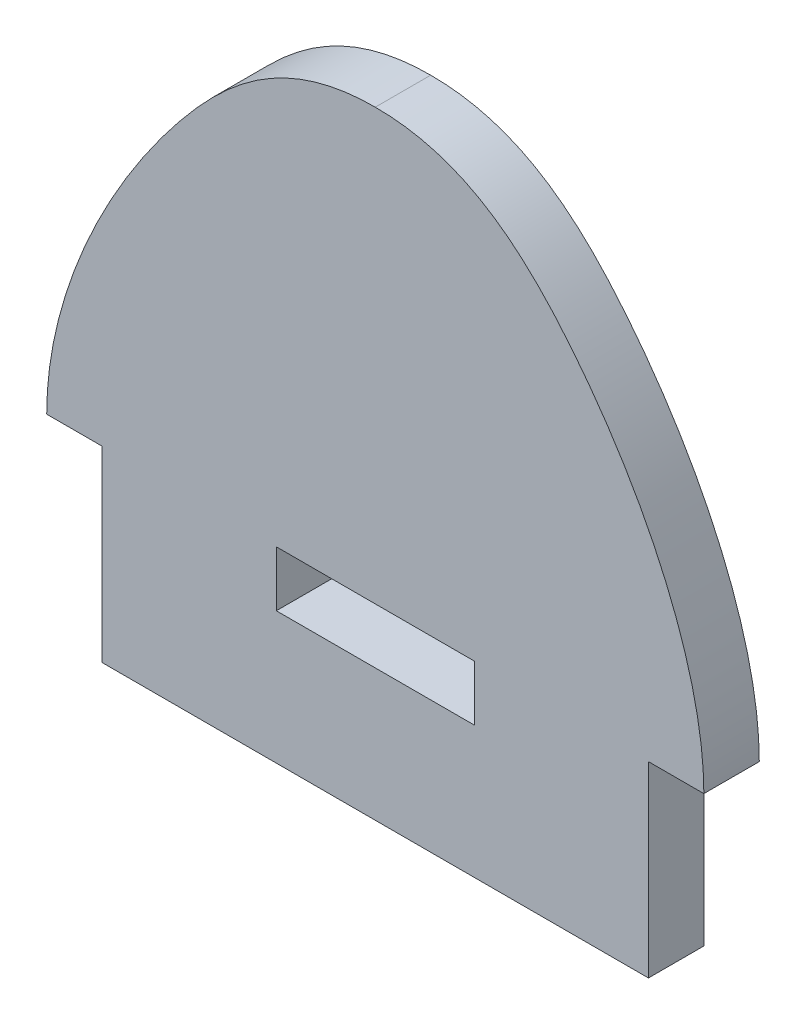
ISO-10303-21;
HEADER;
FILE_DESCRIPTION(('STEP AP214'),'2;1');
FILE_NAME('part.step','',(''),(''),'','','');
FILE_SCHEMA(('AUTOMOTIVE_DESIGN { 1 0 10303 214 1 1 1 1 }'));
ENDSEC;
DATA;
#1=APPLICATION_CONTEXT('core data for automotive mechanical design processes');
#2=APPLICATION_PROTOCOL_DEFINITION('international standard','automotive_design',2000,#1);
#3=PRODUCT_CONTEXT('',#1,'mechanical');
#4=PRODUCT('Part','Part','',(#3));
#5=PRODUCT_RELATED_PRODUCT_CATEGORY('part','',(#4));
#6=PRODUCT_DEFINITION_FORMATION('','',#4);
#7=PRODUCT_DEFINITION_CONTEXT('part definition',#1,'design');
#8=PRODUCT_DEFINITION('design','',#6,#7);
#9=PRODUCT_DEFINITION_SHAPE('','',#8);
#10=(LENGTH_UNIT() NAMED_UNIT(*) SI_UNIT(.MILLI.,.METRE.));
#11=(NAMED_UNIT(*) PLANE_ANGLE_UNIT() SI_UNIT($,.RADIAN.));
#12=(NAMED_UNIT(*) SI_UNIT($,.STERADIAN.) SOLID_ANGLE_UNIT());
#13=UNCERTAINTY_MEASURE_WITH_UNIT(LENGTH_MEASURE(1.E-05),#10,'distance_accuracy_value','');
#14=(GEOMETRIC_REPRESENTATION_CONTEXT(3) GLOBAL_UNCERTAINTY_ASSIGNED_CONTEXT((#13)) GLOBAL_UNIT_ASSIGNED_CONTEXT((#10,
#11,#12)) REPRESENTATION_CONTEXT('',''));
#15=CARTESIAN_POINT('',(0.,0.,0.));
#16=DIRECTION('',(0.,0.,1.));
#17=DIRECTION('',(1.,0.,0.));
#18=AXIS2_PLACEMENT_3D('',#15,#16,#17);
#19=CARTESIAN_POINT('',(0.,0.,5.334));
#20=DIRECTION('',(0.,-1.,0.));
#21=DIRECTION('',(0.,0.,-1.));
#22=AXIS2_PLACEMENT_3D('',#19,#20,#21);
#23=PLANE('',#22);
#24=DIRECTION('',(-1.,0.,0.));
#25=VECTOR('',#24,1.);
#26=CARTESIAN_POINT('',(0.,0.,0.));
#27=LINE('',#26,#25);
#28=CARTESIAN_POINT('',(35.814,0.,0.));
#29=VERTEX_POINT('',#28);
#30=CARTESIAN_POINT('',(16.764,0.,0.));
#31=VERTEX_POINT('',#30);
#32=EDGE_CURVE('E174',#29,#31,#27,.T.);
#33=ORIENTED_EDGE('',*,*,#32,.F.);
#34=DIRECTION('',(0.,0.,-1.));
#35=VECTOR('',#34,1.);
#36=CARTESIAN_POINT('',(35.814,0.,5.334));
#37=LINE('',#36,#35);
#38=CARTESIAN_POINT('',(35.814,0.,5.334));
#39=VERTEX_POINT('',#38);
#40=EDGE_CURVE('E11',#39,#29,#37,.T.);
#41=ORIENTED_EDGE('',*,*,#40,.F.);
#42=DIRECTION('',(-1.,0.,0.));
#43=VECTOR('',#42,1.);
#44=CARTESIAN_POINT('',(0.,0.,5.334));
#45=LINE('',#44,#43);
#46=CARTESIAN_POINT('',(16.764,0.,5.334));
#47=VERTEX_POINT('',#46);
#48=EDGE_CURVE('E137',#39,#47,#45,.T.);
#49=ORIENTED_EDGE('',*,*,#48,.T.);
#50=DIRECTION('',(0.,0.,-1.));
#51=VECTOR('',#50,1.);
#52=CARTESIAN_POINT('',(16.764,0.,5.334));
#53=LINE('',#52,#51);
#54=EDGE_CURVE('E57',#47,#31,#53,.T.);
#55=ORIENTED_EDGE('',*,*,#54,.T.);
#56=EDGE_LOOP('',(#33,#41,#49,#55));
#57=FACE_BOUND('',#56,.T.);
#58=ADVANCED_FACE('F37',(#57),#23,.T.);
#59=CARTESIAN_POINT('',(35.814,0.,5.334));
#60=DIRECTION('',(1.,0.,0.));
#61=DIRECTION('',(0.,0.,-1.));
#62=AXIS2_PLACEMENT_3D('',#59,#60,#61);
#63=PLANE('',#62);
#64=DIRECTION('',(0.,-1.,0.));
#65=VECTOR('',#64,1.);
#66=CARTESIAN_POINT('',(35.814,0.,0.));
#67=LINE('',#66,#65);
#68=CARTESIAN_POINT('',(35.814,-5.334,0.));
#69=VERTEX_POINT('',#68);
#70=EDGE_CURVE('E143',#29,#69,#67,.T.);
#71=ORIENTED_EDGE('',*,*,#70,.T.);
#72=DIRECTION('',(0.,0.,-1.));
#73=VECTOR('',#72,1.);
#74=CARTESIAN_POINT('',(35.814,-5.334,5.334));
#75=LINE('',#74,#73);
#76=CARTESIAN_POINT('',(35.814,-5.334,5.334));
#77=VERTEX_POINT('',#76);
#78=EDGE_CURVE('E48',#77,#69,#75,.T.);
#79=ORIENTED_EDGE('',*,*,#78,.F.);
#80=DIRECTION('',(0.,-1.,0.));
#81=VECTOR('',#80,1.);
#82=CARTESIAN_POINT('',(35.814,0.,5.334));
#83=LINE('',#82,#81);
#84=EDGE_CURVE('E131',#39,#77,#83,.T.);
#85=ORIENTED_EDGE('',*,*,#84,.F.);
#86=ORIENTED_EDGE('',*,*,#40,.T.);
#87=EDGE_LOOP('',(#71,#79,#85,#86));
#88=FACE_BOUND('',#87,.T.);
#89=ADVANCED_FACE('F141',(#88),#63,.F.);
#90=CARTESIAN_POINT('',(0.,-5.334,5.334));
#91=DIRECTION('',(0.,1.,0.));
#92=DIRECTION('',(-1.,0.,0.));
#93=AXIS2_PLACEMENT_3D('',#90,#91,#92);
#94=PLANE('',#93);
#95=DIRECTION('',(1.,0.,0.));
#96=VECTOR('',#95,1.);
#97=CARTESIAN_POINT('',(0.,-5.334,0.));
#98=LINE('',#97,#96);
#99=CARTESIAN_POINT('',(16.764,-5.334,0.));
#100=VERTEX_POINT('',#99);
#101=EDGE_CURVE('E186',#100,#69,#98,.T.);
#102=ORIENTED_EDGE('',*,*,#101,.F.);
#103=DIRECTION('',(0.,0.,-1.));
#104=VECTOR('',#103,1.);
#105=CARTESIAN_POINT('',(16.764,-5.334,5.334));
#106=LINE('',#105,#104);
#107=CARTESIAN_POINT('',(16.764,-5.334,5.334));
#108=VERTEX_POINT('',#107);
#109=EDGE_CURVE('E91',#108,#100,#106,.T.);
#110=ORIENTED_EDGE('',*,*,#109,.F.);
#111=DIRECTION('',(1.,0.,0.));
#112=VECTOR('',#111,1.);
#113=CARTESIAN_POINT('',(0.,-5.334,5.334));
#114=LINE('',#113,#112);
#115=EDGE_CURVE('E136',#108,#77,#114,.T.);
#116=ORIENTED_EDGE('',*,*,#115,.T.);
#117=ORIENTED_EDGE('',*,*,#78,.T.);
#118=EDGE_LOOP('',(#102,#110,#116,#117));
#119=FACE_BOUND('',#118,.T.);
#120=ADVANCED_FACE('F147',(#119),#94,.T.);
#121=CARTESIAN_POINT('',(57.912,0.,5.334));
#122=CARTESIAN_POINT('',(57.912,10.018830830654,5.334));
#123=CARTESIAN_POINT('',(48.9465453048913,29.2855997606862,5.334));
#124=CARTESIAN_POINT('',(34.8883944615004,41.402,5.334));
#125=CARTESIAN_POINT('',(26.289,41.402,5.334));
#126=B_SPLINE_CURVE_WITH_KNOTS('',3,(#121,#122,#123,#124,#125),.UNSPECIFIED.,.F.,.F.,(4,1,4),
(0.,0.604390218483786,1.),.UNSPECIFIED.);
#127=DIRECTION('',(0.,0.,-1.));
#128=VECTOR('',#127,1.);
#129=SURFACE_OF_LINEAR_EXTRUSION('',#126,#128);
#130=CARTESIAN_POINT('',(57.912,0.,0.));
#131=CARTESIAN_POINT('',(57.912,10.018830830654,0.));
#132=CARTESIAN_POINT('',(48.9465453048913,29.2855997606862,0.));
#133=CARTESIAN_POINT('',(34.8883944615004,41.402,0.));
#134=CARTESIAN_POINT('',(26.289,41.402,0.));
#135=B_SPLINE_CURVE_WITH_KNOTS('',3,(#130,#131,#132,#133,#134),.UNSPECIFIED.,.F.,.F.,(4,1,4),
(0.,0.604390218483786,1.),.UNSPECIFIED.);
#136=CARTESIAN_POINT('',(57.912,0.,0.));
#137=VERTEX_POINT('',#136);
#138=CARTESIAN_POINT('',(26.289,41.402,0.));
#139=VERTEX_POINT('',#138);
#140=EDGE_CURVE('E154',#137,#139,#135,.T.);
#141=ORIENTED_EDGE('',*,*,#140,.T.);
#142=DIRECTION('',(0.,0.,-1.));
#143=VECTOR('',#142,1.);
#144=CARTESIAN_POINT('',(26.289,41.402,5.334));
#145=LINE('',#144,#143);
#146=CARTESIAN_POINT('',(26.289,41.402,5.334));
#147=VERTEX_POINT('',#146);
#148=EDGE_CURVE('E42',#147,#139,#145,.T.);
#149=ORIENTED_EDGE('',*,*,#148,.F.);
#150=CARTESIAN_POINT('',(57.912,0.,5.334));
#151=VERTEX_POINT('',#150);
#152=EDGE_CURVE('E104',#151,#147,#126,.T.);
#153=ORIENTED_EDGE('',*,*,#152,.F.);
#154=DIRECTION('',(0.,0.,-1.));
#155=VECTOR('',#154,1.);
#156=CARTESIAN_POINT('',(57.912,0.,5.334));
#157=LINE('',#156,#155);
#158=EDGE_CURVE('E150',#151,#137,#157,.T.);
#159=ORIENTED_EDGE('',*,*,#158,.T.);
#160=EDGE_LOOP('',(#141,#149,#153,#159));
#161=FACE_BOUND('',#160,.T.);
#162=ADVANCED_FACE('F39',(#161),#129,.F.);
#163=CARTESIAN_POINT('',(-5.334,0.,5.334));
#164=CARTESIAN_POINT('',(-5.334,10.018830830654,5.334));
#165=CARTESIAN_POINT('',(3.63145469510871,29.2855997606862,5.334));
#166=CARTESIAN_POINT('',(17.6896055384996,41.402,5.334));
#167=CARTESIAN_POINT('',(26.289,41.402,5.334));
#168=B_SPLINE_CURVE_WITH_KNOTS('',3,(#163,#164,#165,#166,#167),.UNSPECIFIED.,.F.,.F.,(4,1,4),
(0.,0.604390218483786,1.),.UNSPECIFIED.);
#169=DIRECTION('',(0.,0.,-1.));
#170=VECTOR('',#169,1.);
#171=SURFACE_OF_LINEAR_EXTRUSION('',#168,#170);
#172=CARTESIAN_POINT('',(-5.334,0.,0.));
#173=CARTESIAN_POINT('',(-5.334,10.018830830654,0.));
#174=CARTESIAN_POINT('',(3.63145469510871,29.2855997606862,0.));
#175=CARTESIAN_POINT('',(17.6896055384996,41.402,0.));
#176=CARTESIAN_POINT('',(26.289,41.402,0.));
#177=B_SPLINE_CURVE_WITH_KNOTS('',3,(#172,#173,#174,#175,#176),.UNSPECIFIED.,.F.,.F.,(4,1,4),
(0.,0.604390218483786,1.),.UNSPECIFIED.);
#178=CARTESIAN_POINT('',(-5.334,0.,0.));
#179=VERTEX_POINT('',#178);
#180=EDGE_CURVE('E159',#179,#139,#177,.T.);
#181=ORIENTED_EDGE('',*,*,#180,.F.);
#182=DIRECTION('',(0.,0.,-1.));
#183=VECTOR('',#182,1.);
#184=CARTESIAN_POINT('',(-5.334,0.,5.334));
#185=LINE('',#184,#183);
#186=CARTESIAN_POINT('',(-5.334,0.,5.334));
#187=VERTEX_POINT('',#186);
#188=EDGE_CURVE('E202',#187,#179,#185,.T.);
#189=ORIENTED_EDGE('',*,*,#188,.F.);
#190=EDGE_CURVE('E210',#187,#147,#168,.T.);
#191=ORIENTED_EDGE('',*,*,#190,.T.);
#192=ORIENTED_EDGE('',*,*,#148,.T.);
#193=EDGE_LOOP('',(#181,#189,#191,#192));
#194=FACE_BOUND('',#193,.T.);
#195=ADVANCED_FACE('F209',(#194),#171,.T.);
#196=CARTESIAN_POINT('',(0.,0.,0.));
#197=VERTEX_POINT('',#196);
#198=EDGE_CURVE('E167',#197,#179,#27,.T.);
#199=ORIENTED_EDGE('',*,*,#198,.F.);
#200=DIRECTION('',(0.,0.,-1.));
#201=VECTOR('',#200,1.);
#202=CARTESIAN_POINT('',(0.,0.,5.334));
#203=LINE('',#202,#201);
#204=CARTESIAN_POINT('',(0.,0.,5.334));
#205=VERTEX_POINT('',#204);
#206=EDGE_CURVE('E201',#205,#197,#203,.T.);
#207=ORIENTED_EDGE('',*,*,#206,.F.);
#208=EDGE_CURVE('E222',#205,#187,#45,.T.);
#209=ORIENTED_EDGE('',*,*,#208,.T.);
#210=ORIENTED_EDGE('',*,*,#188,.T.);
#211=EDGE_LOOP('',(#199,#207,#209,#210));
#212=FACE_BOUND('',#211,.T.);
#213=ADVANCED_FACE('F219',(#212),#23,.T.);
#214=CARTESIAN_POINT('',(0.,0.,5.334));
#215=DIRECTION('',(1.,0.,0.));
#216=DIRECTION('',(0.,1.,0.));
#217=AXIS2_PLACEMENT_3D('',#214,#215,#216);
#218=PLANE('',#217);
#219=DIRECTION('',(0.,-1.,0.));
#220=VECTOR('',#219,1.);
#221=CARTESIAN_POINT('',(0.,0.,0.));
#222=LINE('',#221,#220);
#223=CARTESIAN_POINT('',(0.,-18.034,0.));
#224=VERTEX_POINT('',#223);
#225=EDGE_CURVE('E173',#197,#224,#222,.T.);
#226=ORIENTED_EDGE('',*,*,#225,.T.);
#227=DIRECTION('',(0.,0.,-1.));
#228=VECTOR('',#227,1.);
#229=CARTESIAN_POINT('',(0.,-18.034,5.334));
#230=LINE('',#229,#228);
#231=CARTESIAN_POINT('',(0.,-18.034,5.334));
#232=VERTEX_POINT('',#231);
#233=EDGE_CURVE('E198',#232,#224,#230,.T.);
#234=ORIENTED_EDGE('',*,*,#233,.F.);
#235=DIRECTION('',(0.,-1.,0.));
#236=VECTOR('',#235,1.);
#237=CARTESIAN_POINT('',(0.,0.,5.334));
#238=LINE('',#237,#236);
#239=EDGE_CURVE('E225',#205,#232,#238,.T.);
#240=ORIENTED_EDGE('',*,*,#239,.F.);
#241=ORIENTED_EDGE('',*,*,#206,.T.);
#242=EDGE_LOOP('',(#226,#234,#240,#241));
#243=FACE_BOUND('',#242,.T.);
#244=ADVANCED_FACE('F226',(#243),#218,.F.);
#245=CARTESIAN_POINT('',(0.,-18.034,5.334));
#246=DIRECTION('',(0.,1.,0.));
#247=DIRECTION('',(0.,0.,1.));
#248=AXIS2_PLACEMENT_3D('',#245,#246,#247);
#249=PLANE('',#248);
#250=DIRECTION('',(1.,0.,0.));
#251=VECTOR('',#250,1.);
#252=CARTESIAN_POINT('',(0.,-18.034,0.));
#253=LINE('',#252,#251);
#254=CARTESIAN_POINT('',(52.578,-18.034,0.));
#255=VERTEX_POINT('',#254);
#256=EDGE_CURVE('E176',#224,#255,#253,.T.);
#257=ORIENTED_EDGE('',*,*,#256,.T.);
#258=DIRECTION('',(0.,0.,-1.));
#259=VECTOR('',#258,1.);
#260=CARTESIAN_POINT('',(52.578,-18.034,5.334));
#261=LINE('',#260,#259);
#262=CARTESIAN_POINT('',(52.578,-18.034,5.334));
#263=VERTEX_POINT('',#262);
#264=EDGE_CURVE('E196',#263,#255,#261,.T.);
#265=ORIENTED_EDGE('',*,*,#264,.F.);
#266=DIRECTION('',(1.,0.,0.));
#267=VECTOR('',#266,1.);
#268=CARTESIAN_POINT('',(0.,-18.034,5.334));
#269=LINE('',#268,#267);
#270=EDGE_CURVE('E228',#232,#263,#269,.T.);
#271=ORIENTED_EDGE('',*,*,#270,.F.);
#272=ORIENTED_EDGE('',*,*,#233,.T.);
#273=EDGE_LOOP('',(#257,#265,#271,#272));
#274=FACE_BOUND('',#273,.T.);
#275=ADVANCED_FACE('F242',(#274),#249,.F.);
#276=CARTESIAN_POINT('',(52.578,0.,5.334));
#277=DIRECTION('',(1.,0.,0.));
#278=DIRECTION('',(0.,0.,-1.));
#279=AXIS2_PLACEMENT_3D('',#276,#277,#278);
#280=PLANE('',#279);
#281=DIRECTION('',(0.,-1.,0.));
#282=VECTOR('',#281,1.);
#283=CARTESIAN_POINT('',(52.578,0.,0.));
#284=LINE('',#283,#282);
#285=CARTESIAN_POINT('',(52.578,0.,0.));
#286=VERTEX_POINT('',#285);
#287=EDGE_CURVE('E179',#286,#255,#284,.T.);
#288=ORIENTED_EDGE('',*,*,#287,.F.);
#289=DIRECTION('',(0.,0.,-1.));
#290=VECTOR('',#289,1.);
#291=CARTESIAN_POINT('',(52.578,0.,5.334));
#292=LINE('',#291,#290);
#293=CARTESIAN_POINT('',(52.578,0.,5.334));
#294=VERTEX_POINT('',#293);
#295=EDGE_CURVE('E194',#294,#286,#292,.T.);
#296=ORIENTED_EDGE('',*,*,#295,.F.);
#297=DIRECTION('',(0.,-1.,0.));
#298=VECTOR('',#297,1.);
#299=CARTESIAN_POINT('',(52.578,0.,5.334));
#300=LINE('',#299,#298);
#301=EDGE_CURVE('E234',#294,#263,#300,.T.);
#302=ORIENTED_EDGE('',*,*,#301,.T.);
#303=ORIENTED_EDGE('',*,*,#264,.T.);
#304=EDGE_LOOP('',(#288,#296,#302,#303));
#305=FACE_BOUND('',#304,.T.);
#306=ADVANCED_FACE('F245',(#305),#280,.T.);
#307=CARTESIAN_POINT('',(0.,0.,5.334));
#308=DIRECTION('',(0.,-1.,0.));
#309=DIRECTION('',(0.,0.,-1.));
#310=AXIS2_PLACEMENT_3D('',#307,#308,#309);
#311=PLANE('',#310);
#312=DIRECTION('',(-1.,0.,0.));
#313=VECTOR('',#312,1.);
#314=CARTESIAN_POINT('',(0.,0.,0.));
#315=LINE('',#314,#313);
#316=EDGE_CURVE('E182',#137,#286,#315,.T.);
#317=ORIENTED_EDGE('',*,*,#316,.F.);
#318=ORIENTED_EDGE('',*,*,#158,.F.);
#319=DIRECTION('',(-1.,0.,0.));
#320=VECTOR('',#319,1.);
#321=CARTESIAN_POINT('',(0.,0.,5.334));
#322=LINE('',#321,#320);
#323=EDGE_CURVE('E232',#151,#294,#322,.T.);
#324=ORIENTED_EDGE('',*,*,#323,.T.);
#325=ORIENTED_EDGE('',*,*,#295,.T.);
#326=EDGE_LOOP('',(#317,#318,#324,#325));
#327=FACE_BOUND('',#326,.T.);
#328=ADVANCED_FACE('F246',(#327),#311,.T.);
#329=CARTESIAN_POINT('',(16.764,0.,5.334));
#330=DIRECTION('',(1.,0.,0.));
#331=DIRECTION('',(0.,0.,-1.));
#332=AXIS2_PLACEMENT_3D('',#329,#330,#331);
#333=PLANE('',#332);
#334=DIRECTION('',(0.,-1.,0.));
#335=VECTOR('',#334,1.);
#336=CARTESIAN_POINT('',(16.764,0.,0.));
#337=LINE('',#336,#335);
#338=EDGE_CURVE('E188',#31,#100,#337,.T.);
#339=ORIENTED_EDGE('',*,*,#338,.F.);
#340=ORIENTED_EDGE('',*,*,#54,.F.);
#341=DIRECTION('',(0.,-1.,0.));
#342=VECTOR('',#341,1.);
#343=CARTESIAN_POINT('',(16.764,0.,5.334));
#344=LINE('',#343,#342);
#345=EDGE_CURVE('E148',#47,#108,#344,.T.);
#346=ORIENTED_EDGE('',*,*,#345,.T.);
#347=ORIENTED_EDGE('',*,*,#109,.T.);
#348=EDGE_LOOP('',(#339,#340,#346,#347));
#349=FACE_BOUND('',#348,.T.);
#350=ADVANCED_FACE('F269',(#349),#333,.T.);
#351=CARTESIAN_POINT('',(0.,0.,5.334));
#352=DIRECTION('',(0.,0.,1.));
#353=DIRECTION('',(1.,0.,0.));
#354=AXIS2_PLACEMENT_3D('',#351,#352,#353);
#355=PLANE('',#354);
#356=ORIENTED_EDGE('',*,*,#152,.T.);
#357=ORIENTED_EDGE('',*,*,#190,.F.);
#358=ORIENTED_EDGE('',*,*,#208,.F.);
#359=ORIENTED_EDGE('',*,*,#239,.T.);
#360=ORIENTED_EDGE('',*,*,#270,.T.);
#361=ORIENTED_EDGE('',*,*,#301,.F.);
#362=ORIENTED_EDGE('',*,*,#323,.F.);
#363=EDGE_LOOP('',(#356,#357,#358,#359,#360,#361,#362));
#364=FACE_BOUND('',#363,.T.);
#365=ORIENTED_EDGE('',*,*,#48,.F.);
#366=ORIENTED_EDGE('',*,*,#84,.T.);
#367=ORIENTED_EDGE('',*,*,#115,.F.);
#368=ORIENTED_EDGE('',*,*,#345,.F.);
#369=EDGE_LOOP('',(#365,#366,#367,#368));
#370=FACE_BOUND('',#369,.T.);
#371=ADVANCED_FACE('F133',(#364,#370),#355,.T.);
#372=CARTESIAN_POINT('',(0.,0.,0.));
#373=DIRECTION('',(0.,0.,1.));
#374=DIRECTION('',(1.,0.,0.));
#375=AXIS2_PLACEMENT_3D('',#372,#373,#374);
#376=PLANE('',#375);
#377=ORIENTED_EDGE('',*,*,#140,.F.);
#378=ORIENTED_EDGE('',*,*,#316,.T.);
#379=ORIENTED_EDGE('',*,*,#287,.T.);
#380=ORIENTED_EDGE('',*,*,#256,.F.);
#381=ORIENTED_EDGE('',*,*,#225,.F.);
#382=ORIENTED_EDGE('',*,*,#198,.T.);
#383=ORIENTED_EDGE('',*,*,#180,.T.);
#384=EDGE_LOOP('',(#377,#378,#379,#380,#381,#382,#383));
#385=FACE_BOUND('',#384,.T.);
#386=ORIENTED_EDGE('',*,*,#32,.T.);
#387=ORIENTED_EDGE('',*,*,#338,.T.);
#388=ORIENTED_EDGE('',*,*,#101,.T.);
#389=ORIENTED_EDGE('',*,*,#70,.F.);
#390=EDGE_LOOP('',(#386,#387,#388,#389));
#391=FACE_BOUND('',#390,.T.);
#392=ADVANCED_FACE('F215',(#385,#391),#376,.F.);
#393=CLOSED_SHELL('',(#58,#89,#120,#162,#195,#213,#244,#275,#306,#328,#350,#371,#392));
#394=MANIFOLD_SOLID_BREP('B2',#393);
#395=ADVANCED_BREP_SHAPE_REPRESENTATION('',(#18,#394),#14);
#396=SHAPE_DEFINITION_REPRESENTATION(#9,#395);
ENDSEC;
END-ISO-10303-21;
